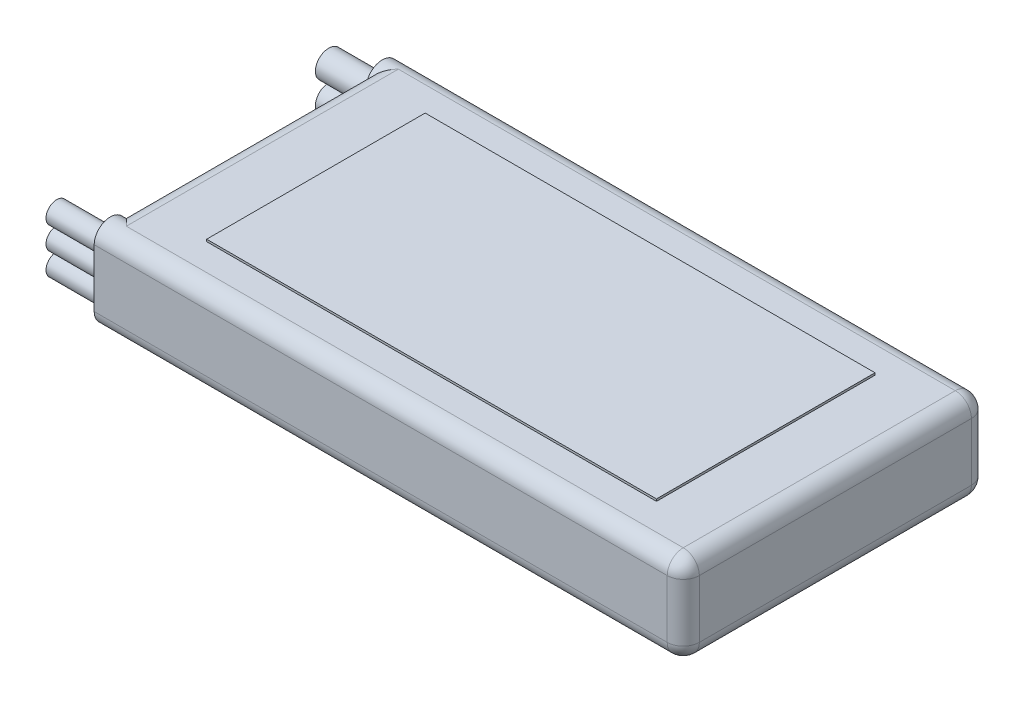
ISO-10303-21;
HEADER;
FILE_DESCRIPTION(('STEP AP214'),'2;1');
FILE_NAME('part.step','',(''),(''),'','','');
FILE_SCHEMA(('AUTOMOTIVE_DESIGN { 1 0 10303 214 1 1 1 1 }'));
ENDSEC;
DATA;
#1=APPLICATION_CONTEXT('core data for automotive mechanical design processes');
#2=APPLICATION_PROTOCOL_DEFINITION('international standard','automotive_design',2000,#1);
#3=PRODUCT_CONTEXT('',#1,'mechanical');
#4=PRODUCT('Part','Part','',(#3));
#5=PRODUCT_RELATED_PRODUCT_CATEGORY('part','',(#4));
#6=PRODUCT_DEFINITION_FORMATION('','',#4);
#7=PRODUCT_DEFINITION_CONTEXT('part definition',#1,'design');
#8=PRODUCT_DEFINITION('design','',#6,#7);
#9=PRODUCT_DEFINITION_SHAPE('','',#8);
#10=(LENGTH_UNIT() NAMED_UNIT(*) SI_UNIT(.MILLI.,.METRE.));
#11=(NAMED_UNIT(*) PLANE_ANGLE_UNIT() SI_UNIT($,.RADIAN.));
#12=(NAMED_UNIT(*) SI_UNIT($,.STERADIAN.) SOLID_ANGLE_UNIT());
#13=UNCERTAINTY_MEASURE_WITH_UNIT(LENGTH_MEASURE(1.E-05),#10,'distance_accuracy_value','');
#14=(GEOMETRIC_REPRESENTATION_CONTEXT(3) GLOBAL_UNCERTAINTY_ASSIGNED_CONTEXT((#13)) GLOBAL_UNIT_ASSIGNED_CONTEXT((#10,
#11,#12)) REPRESENTATION_CONTEXT('',''));
#15=CARTESIAN_POINT('',(0.,0.,0.));
#16=DIRECTION('',(0.,0.,1.));
#17=DIRECTION('',(1.,0.,0.));
#18=AXIS2_PLACEMENT_3D('',#15,#16,#17);
#19=CARTESIAN_POINT('',(0.,10.668,0.));
#20=DIRECTION('',(0.,1.,0.));
#21=DIRECTION('',(0.,0.,1.));
#22=AXIS2_PLACEMENT_3D('',#19,#20,#21);
#23=PLANE('',#22);
#24=DIRECTION('',(0.,0.,-1.));
#25=VECTOR('',#24,1.);
#26=CARTESIAN_POINT('',(41.4199177552008,10.668,-23.1597613288179));
#27=LINE('',#26,#25);
#28=CARTESIAN_POINT('',(41.4199177552008,10.668,11.0032386711821));
#29=VERTEX_POINT('',#28);
#30=CARTESIAN_POINT('',(41.4199177552008,10.668,-21.2547613288179));
#31=VERTEX_POINT('',#30);
#32=EDGE_CURVE('E256',#29,#31,#27,.T.);
#33=ORIENTED_EDGE('',*,*,#32,.T.);
#34=DIRECTION('',(-1.,0.,0.));
#35=VECTOR('',#34,1.);
#36=CARTESIAN_POINT('',(-26.5250822447992,10.668,-21.2547613288179));
#37=LINE('',#36,#35);
#38=CARTESIAN_POINT('',(-24.6200822447992,10.668,-21.2547613288179));
#39=VERTEX_POINT('',#38);
#40=EDGE_CURVE('E258',#31,#39,#37,.T.);
#41=ORIENTED_EDGE('',*,*,#40,.T.);
#42=DIRECTION('',(0.,0.,1.));
#43=VECTOR('',#42,1.);
#44=CARTESIAN_POINT('',(-24.6200822447992,10.668,12.9082386711821));
#45=LINE('',#44,#43);
#46=CARTESIAN_POINT('',(-24.6200822447992,10.668,11.0032386711821));
#47=VERTEX_POINT('',#46);
#48=EDGE_CURVE('E251',#39,#47,#45,.T.);
#49=ORIENTED_EDGE('',*,*,#48,.T.);
#50=DIRECTION('',(1.,0.,0.));
#51=VECTOR('',#50,1.);
#52=CARTESIAN_POINT('',(43.3249177552008,10.668,11.0032386711821));
#53=LINE('',#52,#51);
#54=EDGE_CURVE('E254',#47,#29,#53,.T.);
#55=ORIENTED_EDGE('',*,*,#54,.T.);
#56=EDGE_LOOP('',(#33,#41,#49,#55));
#57=FACE_BOUND('',#56,.T.);
#58=DIRECTION('',(-1.,0.,0.));
#59=VECTOR('',#58,1.);
#60=CARTESIAN_POINT('',(35.0699177552008,10.668,-18.0797613288179));
#61=LINE('',#60,#59);
#62=CARTESIAN_POINT('',(35.0699177552008,10.668,-18.0797613288179));
#63=VERTEX_POINT('',#62);
#64=CARTESIAN_POINT('',(-18.2700822447992,10.668,-18.0797613288179));
#65=VERTEX_POINT('',#64);
#66=EDGE_CURVE('E631',#63,#65,#61,.T.);
#67=ORIENTED_EDGE('',*,*,#66,.F.);
#68=DIRECTION('',(0.,0.,-1.));
#69=VECTOR('',#68,1.);
#70=CARTESIAN_POINT('',(35.0699177552008,10.668,7.82823867118206));
#71=LINE('',#70,#69);
#72=CARTESIAN_POINT('',(35.0699177552008,10.668,7.82823867118206));
#73=VERTEX_POINT('',#72);
#74=EDGE_CURVE('E171',#73,#63,#71,.T.);
#75=ORIENTED_EDGE('',*,*,#74,.F.);
#76=DIRECTION('',(1.,0.,0.));
#77=VECTOR('',#76,1.);
#78=CARTESIAN_POINT('',(35.0699177552008,10.668,7.82823867118206));
#79=LINE('',#78,#77);
#80=CARTESIAN_POINT('',(-18.2700822447992,10.668,7.82823867118207));
#81=VERTEX_POINT('',#80);
#82=EDGE_CURVE('E167',#81,#73,#79,.T.);
#83=ORIENTED_EDGE('',*,*,#82,.F.);
#84=DIRECTION('',(0.,0.,1.));
#85=VECTOR('',#84,1.);
#86=CARTESIAN_POINT('',(-18.2700822447992,10.668,7.82823867118207));
#87=LINE('',#86,#85);
#88=EDGE_CURVE('E628',#65,#81,#87,.T.);
#89=ORIENTED_EDGE('',*,*,#88,.F.);
#90=EDGE_LOOP('',(#67,#75,#83,#89));
#91=FACE_BOUND('',#90,.T.);
#92=ADVANCED_FACE('F34',(#57,#91),#23,.T.);
#93=CARTESIAN_POINT('',(-26.5250822447992,10.668,-23.1597613288179));
#94=DIRECTION('',(1.,0.,0.));
#95=DIRECTION('',(0.,0.,-1.));
#96=AXIS2_PLACEMENT_3D('',#93,#94,#95);
#97=PLANE('',#96);
#98=CARTESIAN_POINT('',(-26.5250822447992,7.112,-21.2547613288179));
#99=DIRECTION('',(1.,0.,0.));
#100=DIRECTION('',(0.,0.,-1.));
#101=AXIS2_PLACEMENT_3D('',#98,#99,#100);
#102=CIRCLE('',#101,1.5875);
#103=CARTESIAN_POINT('',(-26.5250822447992,7.112,-22.8422613288179));
#104=VERTEX_POINT('',#103);
#105=EDGE_CURVE('E42',#104,#104,#102,.F.);
#106=ORIENTED_EDGE('',*,*,#105,.F.);
#107=EDGE_LOOP('',(#106));
#108=FACE_BOUND('',#107,.T.);
#109=CARTESIAN_POINT('',(-26.5250822447992,5.334,11.0032386711821));
#110=DIRECTION('',(1.,0.,0.));
#111=DIRECTION('',(0.,0.,-1.));
#112=AXIS2_PLACEMENT_3D('',#109,#110,#111);
#113=CIRCLE('',#112,1.27);
#114=CARTESIAN_POINT('',(-26.5250822447992,5.334,9.73323867118206));
#115=VERTEX_POINT('',#114);
#116=EDGE_CURVE('E299',#115,#115,#113,.F.);
#117=ORIENTED_EDGE('',*,*,#116,.F.);
#118=EDGE_LOOP('',(#117));
#119=FACE_BOUND('',#118,.T.);
#120=DIRECTION('',(0.,0.,1.));
#121=VECTOR('',#120,1.);
#122=CARTESIAN_POINT('',(-26.5250822447992,8.763,-23.1597613288179));
#123=LINE('',#122,#121);
#124=CARTESIAN_POINT('',(-26.5250822447992,8.763,9.09823867118206));
#125=VERTEX_POINT('',#124);
#126=CARTESIAN_POINT('',(-26.5250822447992,8.763,-19.3497613288179));
#127=VERTEX_POINT('',#126);
#128=EDGE_CURVE('E239',#125,#127,#123,.F.);
#129=ORIENTED_EDGE('',*,*,#128,.T.);
#130=CARTESIAN_POINT('',(-26.5250822447992,8.763,-21.2547613288179));
#131=DIRECTION('',(-1.,0.,0.));
#132=DIRECTION('',(0.,0.,1.));
#133=AXIS2_PLACEMENT_3D('',#130,#131,#132);
#134=CIRCLE('',#133,1.905);
#135=CARTESIAN_POINT('',(-26.5250822447992,8.763,-23.1597613288179));
#136=VERTEX_POINT('',#135);
#137=EDGE_CURVE('E192',#127,#136,#134,.T.);
#138=ORIENTED_EDGE('',*,*,#137,.T.);
#139=DIRECTION('',(0.,-1.,0.));
#140=VECTOR('',#139,1.);
#141=CARTESIAN_POINT('',(-26.5250822447992,8.763,-23.1597613288179));
#142=LINE('',#141,#140);
#143=CARTESIAN_POINT('',(-26.5250822447992,1.905,-23.1597613288179));
#144=VERTEX_POINT('',#143);
#145=EDGE_CURVE('E195',#136,#144,#142,.T.);
#146=ORIENTED_EDGE('',*,*,#145,.T.);
#147=CARTESIAN_POINT('',(-26.5250822447992,1.905,-21.2547613288179));
#148=DIRECTION('',(-1.,0.,0.));
#149=DIRECTION('',(0.,0.,1.));
#150=AXIS2_PLACEMENT_3D('',#147,#148,#149);
#151=CIRCLE('',#150,1.905);
#152=CARTESIAN_POINT('',(-26.5250822447992,1.905,-19.3497613288179));
#153=VERTEX_POINT('',#152);
#154=EDGE_CURVE('E57',#144,#153,#151,.T.);
#155=ORIENTED_EDGE('',*,*,#154,.T.);
#156=DIRECTION('',(0.,0.,1.));
#157=VECTOR('',#156,1.);
#158=CARTESIAN_POINT('',(-26.5250822447992,1.905,-23.1597613288179));
#159=LINE('',#158,#157);
#160=CARTESIAN_POINT('',(-26.5250822447992,1.905,9.09823867118206));
#161=VERTEX_POINT('',#160);
#162=EDGE_CURVE('E242',#153,#161,#159,.T.);
#163=ORIENTED_EDGE('',*,*,#162,.T.);
#164=CARTESIAN_POINT('',(-26.5250822447992,1.905,11.0032386711821));
#165=DIRECTION('',(-1.,0.,0.));
#166=DIRECTION('',(0.,0.,1.));
#167=AXIS2_PLACEMENT_3D('',#164,#165,#166);
#168=CIRCLE('',#167,1.905);
#169=CARTESIAN_POINT('',(-26.5250822447992,1.905,12.9082386711821));
#170=VERTEX_POINT('',#169);
#171=EDGE_CURVE('E201',#161,#170,#168,.T.);
#172=ORIENTED_EDGE('',*,*,#171,.T.);
#173=DIRECTION('',(0.,1.,0.));
#174=VECTOR('',#173,1.);
#175=CARTESIAN_POINT('',(-26.5250822447992,8.763,12.9082386711821));
#176=LINE('',#175,#174);
#177=CARTESIAN_POINT('',(-26.5250822447992,8.763,12.9082386711821));
#178=VERTEX_POINT('',#177);
#179=EDGE_CURVE('E204',#170,#178,#176,.T.);
#180=ORIENTED_EDGE('',*,*,#179,.T.);
#181=CARTESIAN_POINT('',(-26.5250822447992,8.763,11.0032386711821));
#182=DIRECTION('',(-1.,0.,0.));
#183=DIRECTION('',(0.,0.,1.));
#184=AXIS2_PLACEMENT_3D('',#181,#182,#183);
#185=CIRCLE('',#184,1.905);
#186=EDGE_CURVE('E198',#178,#125,#185,.T.);
#187=ORIENTED_EDGE('',*,*,#186,.T.);
#188=EDGE_LOOP('',(#129,#138,#146,#155,#163,#172,#180,#187));
#189=FACE_BOUND('',#188,.T.);
#190=CARTESIAN_POINT('',(-26.5250822447992,8.001,11.0032386711821));
#191=DIRECTION('',(1.,0.,0.));
#192=DIRECTION('',(0.,0.,-1.));
#193=AXIS2_PLACEMENT_3D('',#190,#191,#192);
#194=CIRCLE('',#193,1.27);
#195=CARTESIAN_POINT('',(-26.5250822447992,8.001,9.73323867118206));
#196=VERTEX_POINT('',#195);
#197=EDGE_CURVE('E296',#196,#196,#194,.F.);
#198=ORIENTED_EDGE('',*,*,#197,.F.);
#199=EDGE_LOOP('',(#198));
#200=FACE_BOUND('',#199,.T.);
#201=CARTESIAN_POINT('',(-26.5250822447992,2.667,11.0032386711821));
#202=DIRECTION('',(1.,0.,0.));
#203=DIRECTION('',(0.,0.,-1.));
#204=AXIS2_PLACEMENT_3D('',#201,#202,#203);
#205=CIRCLE('',#204,1.27);
#206=CARTESIAN_POINT('',(-26.5250822447992,2.667,9.73323867118206));
#207=VERTEX_POINT('',#206);
#208=EDGE_CURVE('E302',#207,#207,#205,.F.);
#209=ORIENTED_EDGE('',*,*,#208,.F.);
#210=EDGE_LOOP('',(#209));
#211=FACE_BOUND('',#210,.T.);
#212=CARTESIAN_POINT('',(-26.5250822447992,3.556,-21.2547613288179));
#213=DIRECTION('',(1.,0.,0.));
#214=DIRECTION('',(0.,0.,-1.));
#215=AXIS2_PLACEMENT_3D('',#212,#213,#214);
#216=CIRCLE('',#215,1.5875);
#217=CARTESIAN_POINT('',(-26.5250822447992,3.556,-22.8422613288179));
#218=VERTEX_POINT('',#217);
#219=EDGE_CURVE('E11',#218,#218,#216,.F.);
#220=ORIENTED_EDGE('',*,*,#219,.F.);
#221=EDGE_LOOP('',(#220));
#222=FACE_BOUND('',#221,.T.);
#223=ADVANCED_FACE('F309',(#108,#119,#189,#200,#211,#222),#97,.F.);
#224=CARTESIAN_POINT('',(-26.5250822447992,10.668,12.9082386711821));
#225=DIRECTION('',(0.,0.,-1.));
#226=DIRECTION('',(-1.,0.,0.));
#227=AXIS2_PLACEMENT_3D('',#224,#225,#226);
#228=PLANE('',#227);
#229=DIRECTION('',(1.,0.,0.));
#230=VECTOR('',#229,1.);
#231=CARTESIAN_POINT('',(-26.5250822447992,1.905,12.9082386711821));
#232=LINE('',#231,#230);
#233=CARTESIAN_POINT('',(41.4199177552008,1.905,12.9082386711821));
#234=VERTEX_POINT('',#233);
#235=EDGE_CURVE('E225',#170,#234,#232,.T.);
#236=ORIENTED_EDGE('',*,*,#235,.T.);
#237=DIRECTION('',(0.,-1.,0.));
#238=VECTOR('',#237,1.);
#239=CARTESIAN_POINT('',(41.4199177552008,10.668,12.9082386711821));
#240=LINE('',#239,#238);
#241=CARTESIAN_POINT('',(41.4199177552008,8.763,12.9082386711821));
#242=VERTEX_POINT('',#241);
#243=EDGE_CURVE('E227',#234,#242,#240,.F.);
#244=ORIENTED_EDGE('',*,*,#243,.T.);
#245=DIRECTION('',(1.,0.,0.));
#246=VECTOR('',#245,1.);
#247=CARTESIAN_POINT('',(-26.5250822447992,8.763,12.9082386711821));
#248=LINE('',#247,#246);
#249=EDGE_CURVE('E223',#242,#178,#248,.F.);
#250=ORIENTED_EDGE('',*,*,#249,.T.);
#251=ORIENTED_EDGE('',*,*,#179,.F.);
#252=EDGE_LOOP('',(#236,#244,#250,#251));
#253=FACE_BOUND('',#252,.T.);
#254=ADVANCED_FACE('F312',(#253),#228,.F.);
#255=CARTESIAN_POINT('',(43.3249177552008,10.668,-23.1597613288179));
#256=DIRECTION('',(-1.,0.,0.));
#257=DIRECTION('',(0.,0.,1.));
#258=AXIS2_PLACEMENT_3D('',#255,#256,#257);
#259=PLANE('',#258);
#260=DIRECTION('',(0.,0.,-1.));
#261=VECTOR('',#260,1.);
#262=CARTESIAN_POINT('',(43.3249177552008,8.763,12.9082386711821));
#263=LINE('',#262,#261);
#264=CARTESIAN_POINT('',(43.3249177552008,8.763,-21.2547613288179));
#265=VERTEX_POINT('',#264);
#266=CARTESIAN_POINT('',(43.3249177552008,8.763,11.0032386711821));
#267=VERTEX_POINT('',#266);
#268=EDGE_CURVE('E213',#265,#267,#263,.F.);
#269=ORIENTED_EDGE('',*,*,#268,.T.);
#270=DIRECTION('',(0.,-1.,0.));
#271=VECTOR('',#270,1.);
#272=CARTESIAN_POINT('',(43.3249177552008,10.668,11.0032386711821));
#273=LINE('',#272,#271);
#274=CARTESIAN_POINT('',(43.3249177552008,1.905,11.0032386711821));
#275=VERTEX_POINT('',#274);
#276=EDGE_CURVE('E220',#267,#275,#273,.T.);
#277=ORIENTED_EDGE('',*,*,#276,.T.);
#278=DIRECTION('',(0.,0.,-1.));
#279=VECTOR('',#278,1.);
#280=CARTESIAN_POINT('',(43.3249177552008,1.905,-23.1597613288179));
#281=LINE('',#280,#279);
#282=CARTESIAN_POINT('',(43.3249177552008,1.905,-21.2547613288179));
#283=VERTEX_POINT('',#282);
#284=EDGE_CURVE('E218',#275,#283,#281,.T.);
#285=ORIENTED_EDGE('',*,*,#284,.T.);
#286=DIRECTION('',(0.,-1.,0.));
#287=VECTOR('',#286,1.);
#288=CARTESIAN_POINT('',(43.3249177552008,10.668,-21.2547613288179));
#289=LINE('',#288,#287);
#290=EDGE_CURVE('E215',#283,#265,#289,.F.);
#291=ORIENTED_EDGE('',*,*,#290,.T.);
#292=EDGE_LOOP('',(#269,#277,#285,#291));
#293=FACE_BOUND('',#292,.T.);
#294=ADVANCED_FACE('F355',(#293),#259,.F.);
#295=CARTESIAN_POINT('',(-26.5250822447992,10.668,-23.1597613288179));
#296=DIRECTION('',(0.,0.,1.));
#297=DIRECTION('',(1.,0.,0.));
#298=AXIS2_PLACEMENT_3D('',#295,#296,#297);
#299=PLANE('',#298);
#300=DIRECTION('',(-1.,0.,0.));
#301=VECTOR('',#300,1.);
#302=CARTESIAN_POINT('',(43.3249177552008,8.763,-23.1597613288179));
#303=LINE('',#302,#301);
#304=CARTESIAN_POINT('',(41.4199177552008,8.763,-23.1597613288179));
#305=VERTEX_POINT('',#304);
#306=EDGE_CURVE('E244',#136,#305,#303,.F.);
#307=ORIENTED_EDGE('',*,*,#306,.T.);
#308=DIRECTION('',(0.,-1.,0.));
#309=VECTOR('',#308,1.);
#310=CARTESIAN_POINT('',(41.4199177552008,10.668,-23.1597613288179));
#311=LINE('',#310,#309);
#312=CARTESIAN_POINT('',(41.4199177552008,1.905,-23.1597613288179));
#313=VERTEX_POINT('',#312);
#314=EDGE_CURVE('E246',#305,#313,#311,.T.);
#315=ORIENTED_EDGE('',*,*,#314,.T.);
#316=DIRECTION('',(-1.,0.,0.));
#317=VECTOR('',#316,1.);
#318=CARTESIAN_POINT('',(-26.5250822447992,1.905,-23.1597613288179));
#319=LINE('',#318,#317);
#320=EDGE_CURVE('E249',#313,#144,#319,.T.);
#321=ORIENTED_EDGE('',*,*,#320,.T.);
#322=ORIENTED_EDGE('',*,*,#145,.F.);
#323=EDGE_LOOP('',(#307,#315,#321,#322));
#324=FACE_BOUND('',#323,.T.);
#325=ADVANCED_FACE('F351',(#324),#299,.F.);
#326=CARTESIAN_POINT('',(0.,0.,0.));
#327=DIRECTION('',(0.,1.,0.));
#328=DIRECTION('',(0.,0.,1.));
#329=AXIS2_PLACEMENT_3D('',#326,#327,#328);
#330=PLANE('',#329);
#331=DIRECTION('',(0.,0.,-1.));
#332=VECTOR('',#331,1.);
#333=CARTESIAN_POINT('',(41.4199177552008,0.,0.));
#334=LINE('',#333,#332);
#335=CARTESIAN_POINT('',(41.4199177552008,0.,-21.2547613288179));
#336=VERTEX_POINT('',#335);
#337=CARTESIAN_POINT('',(41.4199177552008,0.,11.0032386711821));
#338=VERTEX_POINT('',#337);
#339=EDGE_CURVE('E235',#336,#338,#334,.F.);
#340=ORIENTED_EDGE('',*,*,#339,.T.);
#341=DIRECTION('',(1.,0.,0.));
#342=VECTOR('',#341,1.);
#343=CARTESIAN_POINT('',(0.,0.,11.0032386711821));
#344=LINE('',#343,#342);
#345=CARTESIAN_POINT('',(-24.6200822447992,0.,11.0032386711821));
#346=VERTEX_POINT('',#345);
#347=EDGE_CURVE('E237',#338,#346,#344,.F.);
#348=ORIENTED_EDGE('',*,*,#347,.T.);
#349=DIRECTION('',(0.,0.,1.));
#350=VECTOR('',#349,1.);
#351=CARTESIAN_POINT('',(-24.6200822447992,0.,0.));
#352=LINE('',#351,#350);
#353=CARTESIAN_POINT('',(-24.6200822447992,0.,-21.2547613288179));
#354=VERTEX_POINT('',#353);
#355=EDGE_CURVE('E232',#346,#354,#352,.F.);
#356=ORIENTED_EDGE('',*,*,#355,.T.);
#357=DIRECTION('',(-1.,0.,0.));
#358=VECTOR('',#357,1.);
#359=CARTESIAN_POINT('',(0.,0.,-21.2547613288179));
#360=LINE('',#359,#358);
#361=EDGE_CURVE('E230',#354,#336,#360,.F.);
#362=ORIENTED_EDGE('',*,*,#361,.T.);
#363=EDGE_LOOP('',(#340,#348,#356,#362));
#364=FACE_BOUND('',#363,.T.);
#365=ADVANCED_FACE('F348',(#364),#330,.F.);
#366=CARTESIAN_POINT('',(-24.6200822447992,8.763,0.));
#367=DIRECTION('',(0.,0.,-1.));
#368=DIRECTION('',(-1.,0.,0.));
#369=AXIS2_PLACEMENT_3D('',#366,#367,#368);
#370=CYLINDRICAL_SURFACE('',#369,1.905);
#371=CARTESIAN_POINT('',(-24.6200822447992,8.763,-21.2547613288179));
#372=DIRECTION('',(-0.707106781186548,0.,-0.707106781186547));
#373=DIRECTION('',(0.707106781186547,0.,-0.707106781186548));
#374=AXIS2_PLACEMENT_3D('',#371,#372,#373);
#375=ELLIPSE('',#374,2.69407683632074,1.905);
#376=EDGE_CURVE('E293',#127,#39,#375,.T.);
#377=ORIENTED_EDGE('',*,*,#376,.F.);
#378=ORIENTED_EDGE('',*,*,#128,.F.);
#379=CARTESIAN_POINT('',(-24.6200822447992,8.763,11.0032386711821));
#380=DIRECTION('',(0.707106781186547,0.,-0.707106781186548));
#381=DIRECTION('',(-0.707106781186548,0.,-0.707106781186547));
#382=AXIS2_PLACEMENT_3D('',#379,#380,#381);
#383=ELLIPSE('',#382,2.69407683632075,1.905);
#384=EDGE_CURVE('E210',#47,#125,#383,.F.);
#385=ORIENTED_EDGE('',*,*,#384,.F.);
#386=ORIENTED_EDGE('',*,*,#48,.F.);
#387=EDGE_LOOP('',(#377,#378,#385,#386));
#388=FACE_BOUND('',#387,.T.);
#389=ADVANCED_FACE('F36',(#388),#370,.T.);
#390=CARTESIAN_POINT('',(0.,8.763,-21.2547613288179));
#391=DIRECTION('',(1.,0.,0.));
#392=DIRECTION('',(0.,0.,-1.));
#393=AXIS2_PLACEMENT_3D('',#390,#391,#392);
#394=CYLINDRICAL_SURFACE('',#393,1.905);
#395=ORIENTED_EDGE('',*,*,#376,.T.);
#396=ORIENTED_EDGE('',*,*,#40,.F.);
#397=CARTESIAN_POINT('',(41.4199177552008,8.763,-21.2547613288179));
#398=DIRECTION('',(1.,0.,0.));
#399=DIRECTION('',(0.,1.,0.));
#400=AXIS2_PLACEMENT_3D('',#397,#398,#399);
#401=CIRCLE('',#400,1.905);
#402=EDGE_CURVE('E216',#305,#31,#401,.T.);
#403=ORIENTED_EDGE('',*,*,#402,.F.);
#404=ORIENTED_EDGE('',*,*,#306,.F.);
#405=ORIENTED_EDGE('',*,*,#137,.F.);
#406=EDGE_LOOP('',(#395,#396,#403,#404,#405));
#407=FACE_BOUND('',#406,.T.);
#408=ADVANCED_FACE('F409',(#407),#394,.T.);
#409=CARTESIAN_POINT('',(41.4199177552008,10.668,-21.2547613288179));
#410=DIRECTION('',(0.,-1.,0.));
#411=DIRECTION('',(0.,0.,-1.));
#412=AXIS2_PLACEMENT_3D('',#409,#410,#411);
#413=CYLINDRICAL_SURFACE('',#412,1.905);
#414=CARTESIAN_POINT('',(41.4199177552008,1.905,-21.2547613288179));
#415=DIRECTION('',(0.,-1.,0.));
#416=DIRECTION('',(0.,0.,-1.));
#417=AXIS2_PLACEMENT_3D('',#414,#415,#416);
#418=CIRCLE('',#417,1.905);
#419=EDGE_CURVE('E284',#313,#283,#418,.T.);
#420=ORIENTED_EDGE('',*,*,#419,.F.);
#421=ORIENTED_EDGE('',*,*,#314,.F.);
#422=CARTESIAN_POINT('',(41.4199177552008,8.763,-21.2547613288179));
#423=DIRECTION('',(0.,1.,0.));
#424=DIRECTION('',(0.,0.,1.));
#425=AXIS2_PLACEMENT_3D('',#422,#423,#424);
#426=CIRCLE('',#425,1.905);
#427=EDGE_CURVE('E287',#265,#305,#426,.T.);
#428=ORIENTED_EDGE('',*,*,#427,.F.);
#429=ORIENTED_EDGE('',*,*,#290,.F.);
#430=EDGE_LOOP('',(#420,#421,#428,#429));
#431=FACE_BOUND('',#430,.T.);
#432=ADVANCED_FACE('F406',(#431),#413,.T.);
#433=CARTESIAN_POINT('',(-26.5250822447992,1.905,-21.2547613288179));
#434=DIRECTION('',(-1.,0.,0.));
#435=DIRECTION('',(0.,0.,1.));
#436=AXIS2_PLACEMENT_3D('',#433,#434,#435);
#437=CYLINDRICAL_SURFACE('',#436,1.905);
#438=ORIENTED_EDGE('',*,*,#154,.F.);
#439=ORIENTED_EDGE('',*,*,#320,.F.);
#440=CARTESIAN_POINT('',(41.4199177552008,1.905,-21.2547613288179));
#441=DIRECTION('',(1.,0.,0.));
#442=DIRECTION('',(0.,0.,-1.));
#443=AXIS2_PLACEMENT_3D('',#440,#441,#442);
#444=CIRCLE('',#443,1.905);
#445=EDGE_CURVE('E282',#336,#313,#444,.T.);
#446=ORIENTED_EDGE('',*,*,#445,.F.);
#447=ORIENTED_EDGE('',*,*,#361,.F.);
#448=CARTESIAN_POINT('',(-24.6200822447992,1.905,-21.2547613288179));
#449=DIRECTION('',(0.707106781186548,0.,0.707106781186547));
#450=DIRECTION('',(-0.707106781186547,0.,0.707106781186548));
#451=AXIS2_PLACEMENT_3D('',#448,#449,#450);
#452=ELLIPSE('',#451,2.69407683632074,1.905);
#453=EDGE_CURVE('E260',#354,#153,#452,.F.);
#454=ORIENTED_EDGE('',*,*,#453,.T.);
#455=EDGE_LOOP('',(#438,#439,#446,#447,#454));
#456=FACE_BOUND('',#455,.T.);
#457=ADVANCED_FACE('F402',(#456),#437,.T.);
#458=CARTESIAN_POINT('',(-24.6200822447992,1.905,-23.1597613288179));
#459=DIRECTION('',(0.,0.,1.));
#460=DIRECTION('',(1.,0.,0.));
#461=AXIS2_PLACEMENT_3D('',#458,#459,#460);
#462=CYLINDRICAL_SURFACE('',#461,1.905);
#463=ORIENTED_EDGE('',*,*,#453,.F.);
#464=ORIENTED_EDGE('',*,*,#355,.F.);
#465=CARTESIAN_POINT('',(-24.6200822447992,1.905,11.0032386711821));
#466=DIRECTION('',(-0.707106781186547,0.,0.707106781186548));
#467=DIRECTION('',(0.707106781186548,0.,0.707106781186547));
#468=AXIS2_PLACEMENT_3D('',#465,#466,#467);
#469=ELLIPSE('',#468,2.69407683632075,1.905);
#470=EDGE_CURVE('E207',#161,#346,#469,.T.);
#471=ORIENTED_EDGE('',*,*,#470,.F.);
#472=ORIENTED_EDGE('',*,*,#162,.F.);
#473=EDGE_LOOP('',(#463,#464,#471,#472));
#474=FACE_BOUND('',#473,.T.);
#475=ADVANCED_FACE('F398',(#474),#462,.T.);
#476=CARTESIAN_POINT('',(41.4199177552008,8.763,-21.2547613288179));
#477=DIRECTION('',(0.,0.,1.));
#478=DIRECTION('',(1.,0.,0.));
#479=AXIS2_PLACEMENT_3D('',#476,#477,#478);
#480=SPHERICAL_SURFACE('',#479,1.905);
#481=ORIENTED_EDGE('',*,*,#427,.T.);
#482=ORIENTED_EDGE('',*,*,#402,.T.);
#483=CARTESIAN_POINT('',(41.4199177552008,8.763,-21.2547613288179));
#484=DIRECTION('',(0.,0.,-1.));
#485=DIRECTION('',(-1.,0.,0.));
#486=AXIS2_PLACEMENT_3D('',#483,#484,#485);
#487=CIRCLE('',#486,1.905);
#488=EDGE_CURVE('E279',#265,#31,#487,.F.);
#489=ORIENTED_EDGE('',*,*,#488,.F.);
#490=EDGE_LOOP('',(#481,#482,#489));
#491=FACE_BOUND('',#490,.T.);
#492=ADVANCED_FACE('F394',(#491),#480,.T.);
#493=CARTESIAN_POINT('',(41.4199177552008,1.905,-21.2547613288179));
#494=DIRECTION('',(0.,0.,1.));
#495=DIRECTION('',(1.,0.,0.));
#496=AXIS2_PLACEMENT_3D('',#493,#494,#495);
#497=SPHERICAL_SURFACE('',#496,1.905);
#498=ORIENTED_EDGE('',*,*,#445,.T.);
#499=ORIENTED_EDGE('',*,*,#419,.T.);
#500=CARTESIAN_POINT('',(41.4199177552008,1.905,-21.2547613288179));
#501=DIRECTION('',(0.,0.,-1.));
#502=DIRECTION('',(-1.,0.,0.));
#503=AXIS2_PLACEMENT_3D('',#500,#501,#502);
#504=CIRCLE('',#503,1.905);
#505=EDGE_CURVE('E276',#336,#283,#504,.F.);
#506=ORIENTED_EDGE('',*,*,#505,.F.);
#507=EDGE_LOOP('',(#498,#499,#506));
#508=FACE_BOUND('',#507,.T.);
#509=ADVANCED_FACE('F390',(#508),#497,.T.);
#510=CARTESIAN_POINT('',(0.,8.763,11.0032386711821));
#511=DIRECTION('',(-1.,0.,0.));
#512=DIRECTION('',(0.,0.,1.));
#513=AXIS2_PLACEMENT_3D('',#510,#511,#512);
#514=CYLINDRICAL_SURFACE('',#513,1.905);
#515=ORIENTED_EDGE('',*,*,#186,.F.);
#516=ORIENTED_EDGE('',*,*,#249,.F.);
#517=CARTESIAN_POINT('',(41.4199177552008,8.763,11.0032386711821));
#518=DIRECTION('',(1.,0.,0.));
#519=DIRECTION('',(0.,0.,-1.));
#520=AXIS2_PLACEMENT_3D('',#517,#518,#519);
#521=CIRCLE('',#520,1.905);
#522=EDGE_CURVE('E273',#29,#242,#521,.T.);
#523=ORIENTED_EDGE('',*,*,#522,.F.);
#524=ORIENTED_EDGE('',*,*,#54,.F.);
#525=ORIENTED_EDGE('',*,*,#384,.T.);
#526=EDGE_LOOP('',(#515,#516,#523,#524,#525));
#527=FACE_BOUND('',#526,.T.);
#528=ADVANCED_FACE('F386',(#527),#514,.T.);
#529=CARTESIAN_POINT('',(41.4199177552008,8.763,0.));
#530=DIRECTION('',(0.,0.,1.));
#531=DIRECTION('',(1.,0.,0.));
#532=AXIS2_PLACEMENT_3D('',#529,#530,#531);
#533=CYLINDRICAL_SURFACE('',#532,1.905);
#534=ORIENTED_EDGE('',*,*,#488,.T.);
#535=ORIENTED_EDGE('',*,*,#32,.F.);
#536=CARTESIAN_POINT('',(41.4199177552008,8.763,11.0032386711821));
#537=DIRECTION('',(0.,0.,1.));
#538=DIRECTION('',(0.,-1.,0.));
#539=AXIS2_PLACEMENT_3D('',#536,#537,#538);
#540=CIRCLE('',#539,1.905);
#541=EDGE_CURVE('E270',#267,#29,#540,.T.);
#542=ORIENTED_EDGE('',*,*,#541,.F.);
#543=ORIENTED_EDGE('',*,*,#268,.F.);
#544=EDGE_LOOP('',(#534,#535,#542,#543));
#545=FACE_BOUND('',#544,.T.);
#546=ADVANCED_FACE('F382',(#545),#533,.T.);
#547=CARTESIAN_POINT('',(41.4199177552008,1.905,-23.1597613288179));
#548=DIRECTION('',(0.,0.,-1.));
#549=DIRECTION('',(-1.,0.,0.));
#550=AXIS2_PLACEMENT_3D('',#547,#548,#549);
#551=CYLINDRICAL_SURFACE('',#550,1.905);
#552=ORIENTED_EDGE('',*,*,#505,.T.);
#553=ORIENTED_EDGE('',*,*,#284,.F.);
#554=CARTESIAN_POINT('',(41.4199177552008,1.905,11.0032386711821));
#555=DIRECTION('',(0.,0.,1.));
#556=DIRECTION('',(1.,0.,0.));
#557=AXIS2_PLACEMENT_3D('',#554,#555,#556);
#558=CIRCLE('',#557,1.905);
#559=EDGE_CURVE('E267',#338,#275,#558,.T.);
#560=ORIENTED_EDGE('',*,*,#559,.F.);
#561=ORIENTED_EDGE('',*,*,#339,.F.);
#562=EDGE_LOOP('',(#552,#553,#560,#561));
#563=FACE_BOUND('',#562,.T.);
#564=ADVANCED_FACE('F378',(#563),#551,.T.);
#565=CARTESIAN_POINT('',(-26.5250822447992,1.905,11.0032386711821));
#566=DIRECTION('',(1.,0.,0.));
#567=DIRECTION('',(0.,0.,-1.));
#568=AXIS2_PLACEMENT_3D('',#565,#566,#567);
#569=CYLINDRICAL_SURFACE('',#568,1.905);
#570=ORIENTED_EDGE('',*,*,#470,.T.);
#571=ORIENTED_EDGE('',*,*,#347,.F.);
#572=CARTESIAN_POINT('',(41.4199177552008,1.905,11.0032386711821));
#573=DIRECTION('',(1.,0.,0.));
#574=DIRECTION('',(0.,0.,-1.));
#575=AXIS2_PLACEMENT_3D('',#572,#573,#574);
#576=CIRCLE('',#575,1.905);
#577=EDGE_CURVE('E264',#234,#338,#576,.T.);
#578=ORIENTED_EDGE('',*,*,#577,.F.);
#579=ORIENTED_EDGE('',*,*,#235,.F.);
#580=ORIENTED_EDGE('',*,*,#171,.F.);
#581=EDGE_LOOP('',(#570,#571,#578,#579,#580));
#582=FACE_BOUND('',#581,.T.);
#583=ADVANCED_FACE('F374',(#582),#569,.T.);
#584=CARTESIAN_POINT('',(41.4199177552008,8.763,11.0032386711821));
#585=DIRECTION('',(0.,0.,1.));
#586=DIRECTION('',(1.,0.,0.));
#587=AXIS2_PLACEMENT_3D('',#584,#585,#586);
#588=SPHERICAL_SURFACE('',#587,1.905);
#589=ORIENTED_EDGE('',*,*,#541,.T.);
#590=ORIENTED_EDGE('',*,*,#522,.T.);
#591=CARTESIAN_POINT('',(41.4199177552008,8.763,11.0032386711821));
#592=DIRECTION('',(0.,1.,0.));
#593=DIRECTION('',(0.,0.,1.));
#594=AXIS2_PLACEMENT_3D('',#591,#592,#593);
#595=CIRCLE('',#594,1.905);
#596=EDGE_CURVE('E262',#267,#242,#595,.F.);
#597=ORIENTED_EDGE('',*,*,#596,.F.);
#598=EDGE_LOOP('',(#589,#590,#597));
#599=FACE_BOUND('',#598,.T.);
#600=ADVANCED_FACE('F370',(#599),#588,.T.);
#601=CARTESIAN_POINT('',(41.4199177552008,1.905,11.0032386711821));
#602=DIRECTION('',(0.,0.,1.));
#603=DIRECTION('',(1.,0.,0.));
#604=AXIS2_PLACEMENT_3D('',#601,#602,#603);
#605=SPHERICAL_SURFACE('',#604,1.905);
#606=ORIENTED_EDGE('',*,*,#577,.T.);
#607=ORIENTED_EDGE('',*,*,#559,.T.);
#608=CARTESIAN_POINT('',(41.4199177552008,1.905,11.0032386711821));
#609=DIRECTION('',(0.,-1.,0.));
#610=DIRECTION('',(0.,0.,-1.));
#611=AXIS2_PLACEMENT_3D('',#608,#609,#610);
#612=CIRCLE('',#611,1.905);
#613=EDGE_CURVE('E212',#234,#275,#612,.F.);
#614=ORIENTED_EDGE('',*,*,#613,.F.);
#615=EDGE_LOOP('',(#606,#607,#614));
#616=FACE_BOUND('',#615,.T.);
#617=ADVANCED_FACE('F366',(#616),#605,.T.);
#618=CARTESIAN_POINT('',(41.4199177552008,10.668,11.0032386711821));
#619=DIRECTION('',(0.,-1.,0.));
#620=DIRECTION('',(0.,0.,-1.));
#621=AXIS2_PLACEMENT_3D('',#618,#619,#620);
#622=CYLINDRICAL_SURFACE('',#621,1.905);
#623=ORIENTED_EDGE('',*,*,#596,.T.);
#624=ORIENTED_EDGE('',*,*,#243,.F.);
#625=ORIENTED_EDGE('',*,*,#613,.T.);
#626=ORIENTED_EDGE('',*,*,#276,.F.);
#627=EDGE_LOOP('',(#623,#624,#625,#626));
#628=FACE_BOUND('',#627,.T.);
#629=ADVANCED_FACE('F363',(#628),#622,.T.);
#630=CARTESIAN_POINT('',(-32.8750822447992,8.001,11.0032386711821));
#631=DIRECTION('',(1.,0.,0.));
#632=DIRECTION('',(0.,0.,-1.));
#633=AXIS2_PLACEMENT_3D('',#630,#631,#632);
#634=CYLINDRICAL_SURFACE('',#633,1.27);
#635=CARTESIAN_POINT('',(-32.8750822447992,8.001,11.0032386711821));
#636=DIRECTION('',(-1.,0.,0.));
#637=DIRECTION('',(0.,0.,1.));
#638=AXIS2_PLACEMENT_3D('',#635,#636,#637);
#639=CIRCLE('',#638,1.27);
#640=CARTESIAN_POINT('',(-32.8750822447992,8.001,12.2732386711821));
#641=VERTEX_POINT('',#640);
#642=EDGE_CURVE('E189',#641,#641,#639,.T.);
#643=ORIENTED_EDGE('',*,*,#642,.F.);
#644=EDGE_LOOP('',(#643));
#645=FACE_BOUND('',#644,.T.);
#646=ORIENTED_EDGE('',*,*,#197,.T.);
#647=EDGE_LOOP('',(#646));
#648=FACE_BOUND('',#647,.T.);
#649=ADVANCED_FACE('F346',(#645,#648),#634,.T.);
#650=CARTESIAN_POINT('',(-32.8750822447992,8.001,11.0032386711821));
#651=DIRECTION('',(-1.,0.,0.));
#652=DIRECTION('',(0.,0.,1.));
#653=AXIS2_PLACEMENT_3D('',#650,#651,#652);
#654=PLANE('',#653);
#655=ORIENTED_EDGE('',*,*,#642,.T.);
#656=EDGE_LOOP('',(#655));
#657=FACE_BOUND('',#656,.T.);
#658=ADVANCED_FACE('F491',(#657),#654,.T.);
#659=CARTESIAN_POINT('',(-32.8750822447992,5.334,11.0032386711821));
#660=DIRECTION('',(1.,0.,0.));
#661=DIRECTION('',(0.,0.,-1.));
#662=AXIS2_PLACEMENT_3D('',#659,#660,#661);
#663=CYLINDRICAL_SURFACE('',#662,1.27);
#664=CARTESIAN_POINT('',(-32.8750822447992,5.334,11.0032386711821));
#665=DIRECTION('',(-1.,0.,0.));
#666=DIRECTION('',(0.,0.,1.));
#667=AXIS2_PLACEMENT_3D('',#664,#665,#666);
#668=CIRCLE('',#667,1.27);
#669=CARTESIAN_POINT('',(-32.8750822447992,5.334,12.2732386711821));
#670=VERTEX_POINT('',#669);
#671=EDGE_CURVE('E186',#670,#670,#668,.T.);
#672=ORIENTED_EDGE('',*,*,#671,.F.);
#673=EDGE_LOOP('',(#672));
#674=FACE_BOUND('',#673,.T.);
#675=ORIENTED_EDGE('',*,*,#116,.T.);
#676=EDGE_LOOP('',(#675));
#677=FACE_BOUND('',#676,.T.);
#678=ADVANCED_FACE('F501',(#674,#677),#663,.T.);
#679=CARTESIAN_POINT('',(-32.8750822447992,5.334,11.0032386711821));
#680=DIRECTION('',(-1.,0.,0.));
#681=DIRECTION('',(0.,0.,1.));
#682=AXIS2_PLACEMENT_3D('',#679,#680,#681);
#683=PLANE('',#682);
#684=ORIENTED_EDGE('',*,*,#671,.T.);
#685=EDGE_LOOP('',(#684));
#686=FACE_BOUND('',#685,.T.);
#687=ADVANCED_FACE('F512',(#686),#683,.T.);
#688=CARTESIAN_POINT('',(-32.8750822447992,2.667,11.0032386711821));
#689=DIRECTION('',(1.,0.,0.));
#690=DIRECTION('',(0.,0.,-1.));
#691=AXIS2_PLACEMENT_3D('',#688,#689,#690);
#692=CYLINDRICAL_SURFACE('',#691,1.27);
#693=CARTESIAN_POINT('',(-32.8750822447992,2.667,11.0032386711821));
#694=DIRECTION('',(-1.,0.,0.));
#695=DIRECTION('',(0.,0.,1.));
#696=AXIS2_PLACEMENT_3D('',#693,#694,#695);
#697=CIRCLE('',#696,1.27);
#698=CARTESIAN_POINT('',(-32.8750822447992,2.667,12.2732386711821));
#699=VERTEX_POINT('',#698);
#700=EDGE_CURVE('E183',#699,#699,#697,.T.);
#701=ORIENTED_EDGE('',*,*,#700,.F.);
#702=EDGE_LOOP('',(#701));
#703=FACE_BOUND('',#702,.T.);
#704=ORIENTED_EDGE('',*,*,#208,.T.);
#705=EDGE_LOOP('',(#704));
#706=FACE_BOUND('',#705,.T.);
#707=ADVANCED_FACE('F524',(#703,#706),#692,.T.);
#708=CARTESIAN_POINT('',(-32.8750822447992,2.667,11.0032386711821));
#709=DIRECTION('',(-1.,0.,0.));
#710=DIRECTION('',(0.,0.,1.));
#711=AXIS2_PLACEMENT_3D('',#708,#709,#710);
#712=PLANE('',#711);
#713=ORIENTED_EDGE('',*,*,#700,.T.);
#714=EDGE_LOOP('',(#713));
#715=FACE_BOUND('',#714,.T.);
#716=ADVANCED_FACE('F535',(#715),#712,.T.);
#717=CARTESIAN_POINT('',(-32.8750822447992,7.112,-21.2547613288179));
#718=DIRECTION('',(1.,0.,0.));
#719=DIRECTION('',(0.,0.,-1.));
#720=AXIS2_PLACEMENT_3D('',#717,#718,#719);
#721=CYLINDRICAL_SURFACE('',#720,1.5875);
#722=CARTESIAN_POINT('',(-32.8750822447992,7.112,-21.2547613288179));
#723=DIRECTION('',(-1.,0.,0.));
#724=DIRECTION('',(0.,0.,1.));
#725=AXIS2_PLACEMENT_3D('',#722,#723,#724);
#726=CIRCLE('',#725,1.5875);
#727=CARTESIAN_POINT('',(-32.8750822447992,7.112,-19.6672613288179));
#728=VERTEX_POINT('',#727);
#729=EDGE_CURVE('E176',#728,#728,#726,.T.);
#730=ORIENTED_EDGE('',*,*,#729,.F.);
#731=EDGE_LOOP('',(#730));
#732=FACE_BOUND('',#731,.T.);
#733=ORIENTED_EDGE('',*,*,#105,.T.);
#734=EDGE_LOOP('',(#733));
#735=FACE_BOUND('',#734,.T.);
#736=ADVANCED_FACE('F307',(#732,#735),#721,.T.);
#737=CARTESIAN_POINT('',(-32.8750822447992,7.112,-21.2547613288179));
#738=DIRECTION('',(-1.,0.,0.));
#739=DIRECTION('',(0.,0.,1.));
#740=AXIS2_PLACEMENT_3D('',#737,#738,#739);
#741=PLANE('',#740);
#742=ORIENTED_EDGE('',*,*,#729,.T.);
#743=EDGE_LOOP('',(#742));
#744=FACE_BOUND('',#743,.T.);
#745=ADVANCED_FACE('F326',(#744),#741,.T.);
#746=CARTESIAN_POINT('',(-32.8750822447992,3.556,-21.2547613288179));
#747=DIRECTION('',(1.,0.,0.));
#748=DIRECTION('',(0.,0.,-1.));
#749=AXIS2_PLACEMENT_3D('',#746,#747,#748);
#750=CYLINDRICAL_SURFACE('',#749,1.5875);
#751=CARTESIAN_POINT('',(-32.8750822447992,3.556,-21.2547613288179));
#752=DIRECTION('',(-1.,0.,0.));
#753=DIRECTION('',(0.,0.,1.));
#754=AXIS2_PLACEMENT_3D('',#751,#752,#753);
#755=CIRCLE('',#754,1.5875);
#756=CARTESIAN_POINT('',(-32.8750822447992,3.556,-19.6672613288179));
#757=VERTEX_POINT('',#756);
#758=EDGE_CURVE('E173',#757,#757,#755,.T.);
#759=ORIENTED_EDGE('',*,*,#758,.F.);
#760=EDGE_LOOP('',(#759));
#761=FACE_BOUND('',#760,.T.);
#762=ORIENTED_EDGE('',*,*,#219,.T.);
#763=EDGE_LOOP('',(#762));
#764=FACE_BOUND('',#763,.T.);
#765=ADVANCED_FACE('F323',(#761,#764),#750,.T.);
#766=CARTESIAN_POINT('',(-32.8750822447992,3.556,-21.2547613288179));
#767=DIRECTION('',(-1.,0.,0.));
#768=DIRECTION('',(0.,0.,1.));
#769=AXIS2_PLACEMENT_3D('',#766,#767,#768);
#770=PLANE('',#769);
#771=ORIENTED_EDGE('',*,*,#758,.T.);
#772=EDGE_LOOP('',(#771));
#773=FACE_BOUND('',#772,.T.);
#774=ADVANCED_FACE('F325',(#773),#770,.T.);
#775=CARTESIAN_POINT('',(35.0699177552008,10.922,7.82823867118206));
#776=DIRECTION('',(-1.,0.,0.));
#777=DIRECTION('',(0.,0.,1.));
#778=AXIS2_PLACEMENT_3D('',#775,#776,#777);
#779=PLANE('',#778);
#780=ORIENTED_EDGE('',*,*,#74,.T.);
#781=DIRECTION('',(0.,-1.,0.));
#782=VECTOR('',#781,1.);
#783=CARTESIAN_POINT('',(35.0699177552008,10.922,-18.0797613288179));
#784=LINE('',#783,#782);
#785=CARTESIAN_POINT('',(35.0699177552008,10.922,-18.0797613288179));
#786=VERTEX_POINT('',#785);
#787=EDGE_CURVE('E152',#786,#63,#784,.T.);
#788=ORIENTED_EDGE('',*,*,#787,.F.);
#789=DIRECTION('',(0.,0.,-1.));
#790=VECTOR('',#789,1.);
#791=CARTESIAN_POINT('',(35.0699177552008,10.922,7.82823867118206));
#792=LINE('',#791,#790);
#793=CARTESIAN_POINT('',(35.0699177552008,10.922,7.82823867118206));
#794=VERTEX_POINT('',#793);
#795=EDGE_CURVE('E159',#794,#786,#792,.T.);
#796=ORIENTED_EDGE('',*,*,#795,.F.);
#797=DIRECTION('',(0.,-1.,0.));
#798=VECTOR('',#797,1.);
#799=CARTESIAN_POINT('',(35.0699177552008,10.922,7.82823867118206));
#800=LINE('',#799,#798);
#801=EDGE_CURVE('E626',#794,#73,#800,.T.);
#802=ORIENTED_EDGE('',*,*,#801,.T.);
#803=EDGE_LOOP('',(#780,#788,#796,#802));
#804=FACE_BOUND('',#803,.T.);
#805=ADVANCED_FACE('F169',(#804),#779,.F.);
#806=CARTESIAN_POINT('',(35.0699177552008,10.922,-18.0797613288179));
#807=DIRECTION('',(0.,0.,1.));
#808=DIRECTION('',(1.,0.,0.));
#809=AXIS2_PLACEMENT_3D('',#806,#807,#808);
#810=PLANE('',#809);
#811=ORIENTED_EDGE('',*,*,#66,.T.);
#812=DIRECTION('',(0.,-1.,0.));
#813=VECTOR('',#812,1.);
#814=CARTESIAN_POINT('',(-18.2700822447992,10.922,-18.0797613288179));
#815=LINE('',#814,#813);
#816=CARTESIAN_POINT('',(-18.2700822447992,10.922,-18.0797613288179));
#817=VERTEX_POINT('',#816);
#818=EDGE_CURVE('E155',#817,#65,#815,.T.);
#819=ORIENTED_EDGE('',*,*,#818,.F.);
#820=DIRECTION('',(-1.,0.,0.));
#821=VECTOR('',#820,1.);
#822=CARTESIAN_POINT('',(35.0699177552008,10.922,-18.0797613288179));
#823=LINE('',#822,#821);
#824=EDGE_CURVE('E148',#786,#817,#823,.T.);
#825=ORIENTED_EDGE('',*,*,#824,.F.);
#826=ORIENTED_EDGE('',*,*,#787,.T.);
#827=EDGE_LOOP('',(#811,#819,#825,#826));
#828=FACE_BOUND('',#827,.T.);
#829=ADVANCED_FACE('F150',(#828),#810,.F.);
#830=CARTESIAN_POINT('',(-18.2700822447992,10.922,7.82823867118207));
#831=DIRECTION('',(1.,0.,0.));
#832=DIRECTION('',(0.,0.,-1.));
#833=AXIS2_PLACEMENT_3D('',#830,#831,#832);
#834=PLANE('',#833);
#835=ORIENTED_EDGE('',*,*,#88,.T.);
#836=DIRECTION('',(0.,-1.,0.));
#837=VECTOR('',#836,1.);
#838=CARTESIAN_POINT('',(-18.2700822447992,10.922,7.82823867118207));
#839=LINE('',#838,#837);
#840=CARTESIAN_POINT('',(-18.2700822447992,10.922,7.82823867118207));
#841=VERTEX_POINT('',#840);
#842=EDGE_CURVE('E49',#841,#81,#839,.T.);
#843=ORIENTED_EDGE('',*,*,#842,.F.);
#844=DIRECTION('',(0.,0.,1.));
#845=VECTOR('',#844,1.);
#846=CARTESIAN_POINT('',(-18.2700822447992,10.922,7.82823867118207));
#847=LINE('',#846,#845);
#848=EDGE_CURVE('E158',#817,#841,#847,.T.);
#849=ORIENTED_EDGE('',*,*,#848,.F.);
#850=ORIENTED_EDGE('',*,*,#818,.T.);
#851=EDGE_LOOP('',(#835,#843,#849,#850));
#852=FACE_BOUND('',#851,.T.);
#853=ADVANCED_FACE('F595',(#852),#834,.F.);
#854=CARTESIAN_POINT('',(35.0699177552008,10.922,7.82823867118206));
#855=DIRECTION('',(0.,0.,-1.));
#856=DIRECTION('',(-1.,0.,0.));
#857=AXIS2_PLACEMENT_3D('',#854,#855,#856);
#858=PLANE('',#857);
#859=ORIENTED_EDGE('',*,*,#82,.T.);
#860=ORIENTED_EDGE('',*,*,#801,.F.);
#861=DIRECTION('',(1.,0.,0.));
#862=VECTOR('',#861,1.);
#863=CARTESIAN_POINT('',(35.0699177552008,10.922,7.82823867118206));
#864=LINE('',#863,#862);
#865=EDGE_CURVE('E163',#841,#794,#864,.T.);
#866=ORIENTED_EDGE('',*,*,#865,.F.);
#867=ORIENTED_EDGE('',*,*,#842,.T.);
#868=EDGE_LOOP('',(#859,#860,#866,#867));
#869=FACE_BOUND('',#868,.T.);
#870=ADVANCED_FACE('F604',(#869),#858,.F.);
#871=CARTESIAN_POINT('',(0.,10.922,0.));
#872=DIRECTION('',(0.,1.,0.));
#873=DIRECTION('',(0.,0.,1.));
#874=AXIS2_PLACEMENT_3D('',#871,#872,#873);
#875=PLANE('',#874);
#876=ORIENTED_EDGE('',*,*,#795,.T.);
#877=ORIENTED_EDGE('',*,*,#824,.T.);
#878=ORIENTED_EDGE('',*,*,#848,.T.);
#879=ORIENTED_EDGE('',*,*,#865,.T.);
#880=EDGE_LOOP('',(#876,#877,#878,#879));
#881=FACE_BOUND('',#880,.T.);
#882=ADVANCED_FACE('F162',(#881),#875,.T.);
#883=CLOSED_SHELL('',(#92,#223,#254,#294,#325,#365,#389,#408,#432,#457,#475,#492,#509,#528,#546,
#564,#583,#600,#617,#629,#649,#658,#678,#687,#707,#716,#736,#745,#765,#774,#805,#829,#853,#870,#882));
#884=MANIFOLD_SOLID_BREP('B2',#883);
#885=ADVANCED_BREP_SHAPE_REPRESENTATION('',(#18,#884),#14);
#886=SHAPE_DEFINITION_REPRESENTATION(#9,#885);
ENDSEC;
END-ISO-10303-21;
